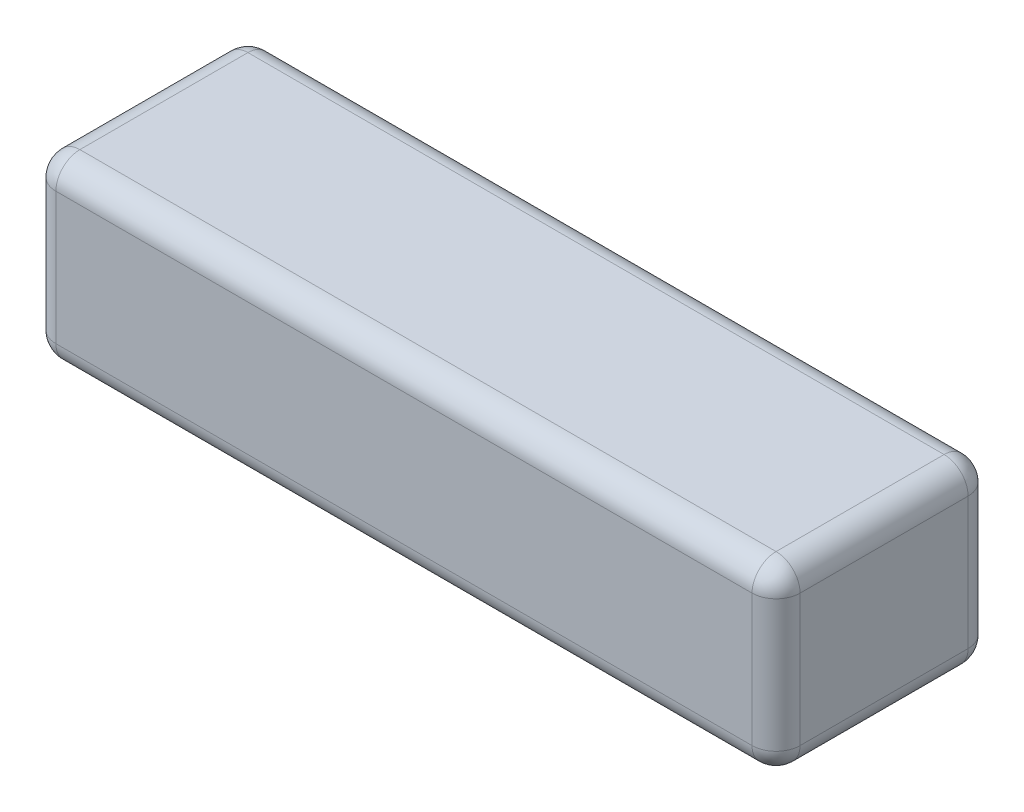
ISO-10303-21;
HEADER;
FILE_DESCRIPTION(('STEP AP214'),'2;1');
FILE_NAME('part.step','',(''),(''),'','','');
FILE_SCHEMA(('AUTOMOTIVE_DESIGN { 1 0 10303 214 1 1 1 1 }'));
ENDSEC;
DATA;
#1=APPLICATION_CONTEXT('core data for automotive mechanical design processes');
#2=APPLICATION_PROTOCOL_DEFINITION('international standard','automotive_design',2000,#1);
#3=PRODUCT_CONTEXT('',#1,'mechanical');
#4=PRODUCT('Part','Part','',(#3));
#5=PRODUCT_RELATED_PRODUCT_CATEGORY('part','',(#4));
#6=PRODUCT_DEFINITION_FORMATION('','',#4);
#7=PRODUCT_DEFINITION_CONTEXT('part definition',#1,'design');
#8=PRODUCT_DEFINITION('design','',#6,#7);
#9=PRODUCT_DEFINITION_SHAPE('','',#8);
#10=(LENGTH_UNIT() NAMED_UNIT(*) SI_UNIT(.MILLI.,.METRE.));
#11=(NAMED_UNIT(*) PLANE_ANGLE_UNIT() SI_UNIT($,.RADIAN.));
#12=(NAMED_UNIT(*) SI_UNIT($,.STERADIAN.) SOLID_ANGLE_UNIT());
#13=UNCERTAINTY_MEASURE_WITH_UNIT(LENGTH_MEASURE(1.E-05),#10,'distance_accuracy_value','');
#14=(GEOMETRIC_REPRESENTATION_CONTEXT(3) GLOBAL_UNCERTAINTY_ASSIGNED_CONTEXT((#13)) GLOBAL_UNIT_ASSIGNED_CONTEXT((#10,
#11,#12)) REPRESENTATION_CONTEXT('',''));
#15=CARTESIAN_POINT('',(0.,0.,0.));
#16=DIRECTION('',(0.,0.,1.));
#17=DIRECTION('',(1.,0.,0.));
#18=AXIS2_PLACEMENT_3D('',#15,#16,#17);
#19=CARTESIAN_POINT('',(31.,7.5,-9.));
#20=DIRECTION('',(-1.,0.,0.));
#21=DIRECTION('',(0.,0.,1.));
#22=AXIS2_PLACEMENT_3D('',#19,#20,#21);
#23=PLANE('',#22);
#24=DIRECTION('',(0.,0.,-1.));
#25=VECTOR('',#24,1.);
#26=CARTESIAN_POINT('',(31.,-5.5,-9.));
#27=LINE('',#26,#25);
#28=CARTESIAN_POINT('',(31.,-5.5,7.));
#29=VERTEX_POINT('',#28);
#30=CARTESIAN_POINT('',(31.,-5.5,-7.));
#31=VERTEX_POINT('',#30);
#32=EDGE_CURVE('E212',#29,#31,#27,.T.);
#33=ORIENTED_EDGE('',*,*,#32,.T.);
#34=DIRECTION('',(0.,-1.,0.));
#35=VECTOR('',#34,1.);
#36=CARTESIAN_POINT('',(31.,7.5,-7.));
#37=LINE('',#36,#35);
#38=CARTESIAN_POINT('',(31.,5.5,-7.));
#39=VERTEX_POINT('',#38);
#40=EDGE_CURVE('E216',#31,#39,#37,.F.);
#41=ORIENTED_EDGE('',*,*,#40,.T.);
#42=DIRECTION('',(0.,0.,-1.));
#43=VECTOR('',#42,1.);
#44=CARTESIAN_POINT('',(31.,5.5,9.));
#45=LINE('',#44,#43);
#46=CARTESIAN_POINT('',(31.,5.5,7.));
#47=VERTEX_POINT('',#46);
#48=EDGE_CURVE('E209',#39,#47,#45,.F.);
#49=ORIENTED_EDGE('',*,*,#48,.T.);
#50=DIRECTION('',(0.,-1.,0.));
#51=VECTOR('',#50,1.);
#52=CARTESIAN_POINT('',(31.,7.5,7.));
#53=LINE('',#52,#51);
#54=EDGE_CURVE('E206',#47,#29,#53,.T.);
#55=ORIENTED_EDGE('',*,*,#54,.T.);
#56=EDGE_LOOP('',(#33,#41,#49,#55));
#57=FACE_BOUND('',#56,.T.);
#58=ADVANCED_FACE('F41',(#57),#23,.F.);
#59=CARTESIAN_POINT('',(-31.,7.5,-9.));
#60=DIRECTION('',(0.,0.,1.));
#61=DIRECTION('',(1.,0.,0.));
#62=AXIS2_PLACEMENT_3D('',#59,#60,#61);
#63=PLANE('',#62);
#64=DIRECTION('',(-1.,0.,0.));
#65=VECTOR('',#64,1.);
#66=CARTESIAN_POINT('',(-31.,-5.5,-9.));
#67=LINE('',#66,#65);
#68=CARTESIAN_POINT('',(29.,-5.5,-9.));
#69=VERTEX_POINT('',#68);
#70=CARTESIAN_POINT('',(-29.,-5.5,-9.));
#71=VERTEX_POINT('',#70);
#72=EDGE_CURVE('E143',#69,#71,#67,.T.);
#73=ORIENTED_EDGE('',*,*,#72,.T.);
#74=DIRECTION('',(0.,-1.,0.));
#75=VECTOR('',#74,1.);
#76=CARTESIAN_POINT('',(-29.,7.5,-9.));
#77=LINE('',#76,#75);
#78=CARTESIAN_POINT('',(-29.,5.5,-9.));
#79=VERTEX_POINT('',#78);
#80=EDGE_CURVE('E138',#71,#79,#77,.F.);
#81=ORIENTED_EDGE('',*,*,#80,.T.);
#82=DIRECTION('',(-1.,0.,0.));
#83=VECTOR('',#82,1.);
#84=CARTESIAN_POINT('',(31.,5.5,-9.));
#85=LINE('',#84,#83);
#86=CARTESIAN_POINT('',(29.,5.5,-9.));
#87=VERTEX_POINT('',#86);
#88=EDGE_CURVE('E130',#79,#87,#85,.F.);
#89=ORIENTED_EDGE('',*,*,#88,.T.);
#90=DIRECTION('',(0.,-1.,0.));
#91=VECTOR('',#90,1.);
#92=CARTESIAN_POINT('',(29.,7.5,-9.));
#93=LINE('',#92,#91);
#94=EDGE_CURVE('E135',#87,#69,#93,.T.);
#95=ORIENTED_EDGE('',*,*,#94,.T.);
#96=EDGE_LOOP('',(#73,#81,#89,#95));
#97=FACE_BOUND('',#96,.T.);
#98=ADVANCED_FACE('F133',(#97),#63,.F.);
#99=CARTESIAN_POINT('',(-31.,7.5,-9.));
#100=DIRECTION('',(1.,0.,0.));
#101=DIRECTION('',(0.,0.,-1.));
#102=AXIS2_PLACEMENT_3D('',#99,#100,#101);
#103=PLANE('',#102);
#104=DIRECTION('',(0.,0.,1.));
#105=VECTOR('',#104,1.);
#106=CARTESIAN_POINT('',(-31.,5.5,-9.));
#107=LINE('',#106,#105);
#108=CARTESIAN_POINT('',(-31.,5.5,7.));
#109=VERTEX_POINT('',#108);
#110=CARTESIAN_POINT('',(-31.,5.5,-7.));
#111=VERTEX_POINT('',#110);
#112=EDGE_CURVE('E51',#109,#111,#107,.F.);
#113=ORIENTED_EDGE('',*,*,#112,.T.);
#114=DIRECTION('',(0.,-1.,0.));
#115=VECTOR('',#114,1.);
#116=CARTESIAN_POINT('',(-31.,7.5,-7.));
#117=LINE('',#116,#115);
#118=CARTESIAN_POINT('',(-31.,-5.5,-7.));
#119=VERTEX_POINT('',#118);
#120=EDGE_CURVE('E11',#111,#119,#117,.T.);
#121=ORIENTED_EDGE('',*,*,#120,.T.);
#122=DIRECTION('',(0.,0.,1.));
#123=VECTOR('',#122,1.);
#124=CARTESIAN_POINT('',(-31.,-5.5,-9.));
#125=LINE('',#124,#123);
#126=CARTESIAN_POINT('',(-31.,-5.5,7.));
#127=VERTEX_POINT('',#126);
#128=EDGE_CURVE('E231',#119,#127,#125,.T.);
#129=ORIENTED_EDGE('',*,*,#128,.T.);
#130=DIRECTION('',(0.,-1.,0.));
#131=VECTOR('',#130,1.);
#132=CARTESIAN_POINT('',(-31.,7.5,7.));
#133=LINE('',#132,#131);
#134=EDGE_CURVE('E62',#127,#109,#133,.F.);
#135=ORIENTED_EDGE('',*,*,#134,.T.);
#136=EDGE_LOOP('',(#113,#121,#129,#135));
#137=FACE_BOUND('',#136,.T.);
#138=ADVANCED_FACE('F326',(#137),#103,.F.);
#139=CARTESIAN_POINT('',(-31.,7.5,9.));
#140=DIRECTION('',(0.,0.,-1.));
#141=DIRECTION('',(-1.,0.,0.));
#142=AXIS2_PLACEMENT_3D('',#139,#140,#141);
#143=PLANE('',#142);
#144=DIRECTION('',(1.,0.,0.));
#145=VECTOR('',#144,1.);
#146=CARTESIAN_POINT('',(-31.,5.5,9.));
#147=LINE('',#146,#145);
#148=CARTESIAN_POINT('',(29.,5.5,9.));
#149=VERTEX_POINT('',#148);
#150=CARTESIAN_POINT('',(-29.,5.5,9.));
#151=VERTEX_POINT('',#150);
#152=EDGE_CURVE('E196',#149,#151,#147,.F.);
#153=ORIENTED_EDGE('',*,*,#152,.T.);
#154=DIRECTION('',(0.,-1.,0.));
#155=VECTOR('',#154,1.);
#156=CARTESIAN_POINT('',(-29.,7.5,9.));
#157=LINE('',#156,#155);
#158=CARTESIAN_POINT('',(-29.,-5.5,9.));
#159=VERTEX_POINT('',#158);
#160=EDGE_CURVE('E203',#151,#159,#157,.T.);
#161=ORIENTED_EDGE('',*,*,#160,.T.);
#162=DIRECTION('',(1.,0.,0.));
#163=VECTOR('',#162,1.);
#164=CARTESIAN_POINT('',(-31.,-5.5,9.));
#165=LINE('',#164,#163);
#166=CARTESIAN_POINT('',(29.,-5.5,9.));
#167=VERTEX_POINT('',#166);
#168=EDGE_CURVE('E199',#159,#167,#165,.T.);
#169=ORIENTED_EDGE('',*,*,#168,.T.);
#170=DIRECTION('',(0.,-1.,0.));
#171=VECTOR('',#170,1.);
#172=CARTESIAN_POINT('',(29.,7.5,9.));
#173=LINE('',#172,#171);
#174=EDGE_CURVE('E193',#167,#149,#173,.F.);
#175=ORIENTED_EDGE('',*,*,#174,.T.);
#176=EDGE_LOOP('',(#153,#161,#169,#175));
#177=FACE_BOUND('',#176,.T.);
#178=ADVANCED_FACE('F349',(#177),#143,.F.);
#179=CARTESIAN_POINT('',(0.,7.5,0.));
#180=DIRECTION('',(0.,1.,0.));
#181=DIRECTION('',(0.,0.,1.));
#182=AXIS2_PLACEMENT_3D('',#179,#180,#181);
#183=PLANE('',#182);
#184=DIRECTION('',(1.,0.,0.));
#185=VECTOR('',#184,1.);
#186=CARTESIAN_POINT('',(31.,7.5,7.));
#187=LINE('',#186,#185);
#188=CARTESIAN_POINT('',(-29.,7.5,7.));
#189=VERTEX_POINT('',#188);
#190=CARTESIAN_POINT('',(29.,7.5,7.));
#191=VERTEX_POINT('',#190);
#192=EDGE_CURVE('E224',#189,#191,#187,.T.);
#193=ORIENTED_EDGE('',*,*,#192,.T.);
#194=DIRECTION('',(0.,0.,-1.));
#195=VECTOR('',#194,1.);
#196=CARTESIAN_POINT('',(29.,7.5,-9.));
#197=LINE('',#196,#195);
#198=CARTESIAN_POINT('',(29.,7.5,-7.));
#199=VERTEX_POINT('',#198);
#200=EDGE_CURVE('E228',#191,#199,#197,.T.);
#201=ORIENTED_EDGE('',*,*,#200,.T.);
#202=DIRECTION('',(-1.,0.,0.));
#203=VECTOR('',#202,1.);
#204=CARTESIAN_POINT('',(-31.,7.5,-7.));
#205=LINE('',#204,#203);
#206=CARTESIAN_POINT('',(-29.,7.5,-7.));
#207=VERTEX_POINT('',#206);
#208=EDGE_CURVE('E150',#199,#207,#205,.T.);
#209=ORIENTED_EDGE('',*,*,#208,.T.);
#210=DIRECTION('',(0.,0.,1.));
#211=VECTOR('',#210,1.);
#212=CARTESIAN_POINT('',(-29.,7.5,9.));
#213=LINE('',#212,#211);
#214=EDGE_CURVE('E219',#207,#189,#213,.T.);
#215=ORIENTED_EDGE('',*,*,#214,.T.);
#216=EDGE_LOOP('',(#193,#201,#209,#215));
#217=FACE_BOUND('',#216,.T.);
#218=ADVANCED_FACE('F366',(#217),#183,.T.);
#219=CARTESIAN_POINT('',(0.,-7.5,0.));
#220=DIRECTION('',(0.,1.,0.));
#221=DIRECTION('',(0.,0.,1.));
#222=AXIS2_PLACEMENT_3D('',#219,#220,#221);
#223=PLANE('',#222);
#224=DIRECTION('',(-1.,0.,0.));
#225=VECTOR('',#224,1.);
#226=CARTESIAN_POINT('',(0.,-7.5,-7.));
#227=LINE('',#226,#225);
#228=CARTESIAN_POINT('',(-29.,-7.5,-7.));
#229=VERTEX_POINT('',#228);
#230=CARTESIAN_POINT('',(29.,-7.5,-7.));
#231=VERTEX_POINT('',#230);
#232=EDGE_CURVE('E186',#229,#231,#227,.F.);
#233=ORIENTED_EDGE('',*,*,#232,.T.);
#234=DIRECTION('',(0.,0.,-1.));
#235=VECTOR('',#234,1.);
#236=CARTESIAN_POINT('',(29.,-7.5,0.));
#237=LINE('',#236,#235);
#238=CARTESIAN_POINT('',(29.,-7.5,7.));
#239=VERTEX_POINT('',#238);
#240=EDGE_CURVE('E190',#231,#239,#237,.F.);
#241=ORIENTED_EDGE('',*,*,#240,.T.);
#242=DIRECTION('',(1.,0.,0.));
#243=VECTOR('',#242,1.);
#244=CARTESIAN_POINT('',(0.,-7.5,7.));
#245=LINE('',#244,#243);
#246=CARTESIAN_POINT('',(-29.,-7.5,7.));
#247=VERTEX_POINT('',#246);
#248=EDGE_CURVE('E183',#239,#247,#245,.F.);
#249=ORIENTED_EDGE('',*,*,#248,.T.);
#250=DIRECTION('',(0.,0.,1.));
#251=VECTOR('',#250,1.);
#252=CARTESIAN_POINT('',(-29.,-7.5,0.));
#253=LINE('',#252,#251);
#254=EDGE_CURVE('E180',#247,#229,#253,.F.);
#255=ORIENTED_EDGE('',*,*,#254,.T.);
#256=EDGE_LOOP('',(#233,#241,#249,#255));
#257=FACE_BOUND('',#256,.T.);
#258=ADVANCED_FACE('F340',(#257),#223,.F.);
#259=CARTESIAN_POINT('',(0.,5.5,7.));
#260=DIRECTION('',(-1.,0.,0.));
#261=DIRECTION('',(0.,0.,1.));
#262=AXIS2_PLACEMENT_3D('',#259,#260,#261);
#263=CYLINDRICAL_SURFACE('',#262,2.);
#264=CARTESIAN_POINT('',(29.,5.5,7.));
#265=DIRECTION('',(1.,0.,0.));
#266=DIRECTION('',(0.,0.,-1.));
#267=AXIS2_PLACEMENT_3D('',#264,#265,#266);
#268=CIRCLE('',#267,2.);
#269=EDGE_CURVE('E45',#191,#149,#268,.T.);
#270=ORIENTED_EDGE('',*,*,#269,.F.);
#271=ORIENTED_EDGE('',*,*,#192,.F.);
#272=CARTESIAN_POINT('',(-29.,5.5,7.));
#273=DIRECTION('',(-1.,0.,0.));
#274=DIRECTION('',(0.,-1.,0.));
#275=AXIS2_PLACEMENT_3D('',#272,#273,#274);
#276=CIRCLE('',#275,2.);
#277=EDGE_CURVE('E174',#151,#189,#276,.T.);
#278=ORIENTED_EDGE('',*,*,#277,.F.);
#279=ORIENTED_EDGE('',*,*,#152,.F.);
#280=EDGE_LOOP('',(#270,#271,#278,#279));
#281=FACE_BOUND('',#280,.T.);
#282=ADVANCED_FACE('F43',(#281),#263,.T.);
#283=CARTESIAN_POINT('',(29.,5.5,7.));
#284=DIRECTION('',(0.,0.,1.));
#285=DIRECTION('',(1.,0.,0.));
#286=AXIS2_PLACEMENT_3D('',#283,#284,#285);
#287=SPHERICAL_SURFACE('',#286,2.);
#288=CARTESIAN_POINT('',(29.,5.5,7.));
#289=DIRECTION('',(0.,0.,1.));
#290=DIRECTION('',(0.,-1.,0.));
#291=AXIS2_PLACEMENT_3D('',#288,#289,#290);
#292=CIRCLE('',#291,2.);
#293=EDGE_CURVE('E297',#191,#47,#292,.F.);
#294=ORIENTED_EDGE('',*,*,#293,.F.);
#295=ORIENTED_EDGE('',*,*,#269,.T.);
#296=CARTESIAN_POINT('',(29.,5.5,7.));
#297=DIRECTION('',(0.,1.,0.));
#298=DIRECTION('',(0.,0.,1.));
#299=AXIS2_PLACEMENT_3D('',#296,#297,#298);
#300=CIRCLE('',#299,2.);
#301=EDGE_CURVE('E301',#47,#149,#300,.F.);
#302=ORIENTED_EDGE('',*,*,#301,.F.);
#303=EDGE_LOOP('',(#294,#295,#302));
#304=FACE_BOUND('',#303,.T.);
#305=ADVANCED_FACE('F354',(#304),#287,.T.);
#306=CARTESIAN_POINT('',(-29.,5.5,7.));
#307=DIRECTION('',(0.,0.,1.));
#308=DIRECTION('',(1.,0.,0.));
#309=AXIS2_PLACEMENT_3D('',#306,#307,#308);
#310=SPHERICAL_SURFACE('',#309,2.);
#311=CARTESIAN_POINT('',(-29.,5.5,7.));
#312=DIRECTION('',(0.,1.,0.));
#313=DIRECTION('',(0.,0.,1.));
#314=AXIS2_PLACEMENT_3D('',#311,#312,#313);
#315=CIRCLE('',#314,2.);
#316=EDGE_CURVE('E290',#151,#109,#315,.F.);
#317=ORIENTED_EDGE('',*,*,#316,.F.);
#318=ORIENTED_EDGE('',*,*,#277,.T.);
#319=CARTESIAN_POINT('',(-29.,5.5,7.));
#320=DIRECTION('',(0.,0.,1.));
#321=DIRECTION('',(1.,0.,0.));
#322=AXIS2_PLACEMENT_3D('',#319,#320,#321);
#323=CIRCLE('',#322,2.);
#324=EDGE_CURVE('E293',#109,#189,#323,.F.);
#325=ORIENTED_EDGE('',*,*,#324,.F.);
#326=EDGE_LOOP('',(#317,#318,#325));
#327=FACE_BOUND('',#326,.T.);
#328=ADVANCED_FACE('F310',(#327),#310,.T.);
#329=CARTESIAN_POINT('',(29.,7.5,7.));
#330=DIRECTION('',(0.,-1.,0.));
#331=DIRECTION('',(0.,0.,-1.));
#332=AXIS2_PLACEMENT_3D('',#329,#330,#331);
#333=CYLINDRICAL_SURFACE('',#332,2.);
#334=ORIENTED_EDGE('',*,*,#301,.T.);
#335=ORIENTED_EDGE('',*,*,#174,.F.);
#336=CARTESIAN_POINT('',(29.,-5.5,7.));
#337=DIRECTION('',(0.,-1.,0.));
#338=DIRECTION('',(0.,0.,-1.));
#339=AXIS2_PLACEMENT_3D('',#336,#337,#338);
#340=CIRCLE('',#339,2.);
#341=EDGE_CURVE('E283',#29,#167,#340,.T.);
#342=ORIENTED_EDGE('',*,*,#341,.F.);
#343=ORIENTED_EDGE('',*,*,#54,.F.);
#344=EDGE_LOOP('',(#334,#335,#342,#343));
#345=FACE_BOUND('',#344,.T.);
#346=ADVANCED_FACE('F357',(#345),#333,.T.);
#347=CARTESIAN_POINT('',(29.,5.5,0.));
#348=DIRECTION('',(0.,0.,1.));
#349=DIRECTION('',(1.,0.,0.));
#350=AXIS2_PLACEMENT_3D('',#347,#348,#349);
#351=CYLINDRICAL_SURFACE('',#350,2.);
#352=ORIENTED_EDGE('',*,*,#293,.T.);
#353=ORIENTED_EDGE('',*,*,#48,.F.);
#354=CARTESIAN_POINT('',(29.,5.5,-7.));
#355=DIRECTION('',(0.,0.,-1.));
#356=DIRECTION('',(-1.,0.,0.));
#357=AXIS2_PLACEMENT_3D('',#354,#355,#356);
#358=CIRCLE('',#357,2.);
#359=EDGE_CURVE('E155',#199,#39,#358,.T.);
#360=ORIENTED_EDGE('',*,*,#359,.F.);
#361=ORIENTED_EDGE('',*,*,#200,.F.);
#362=EDGE_LOOP('',(#352,#353,#360,#361));
#363=FACE_BOUND('',#362,.T.);
#364=ADVANCED_FACE('F364',(#363),#351,.T.);
#365=CARTESIAN_POINT('',(0.,5.5,-7.));
#366=DIRECTION('',(1.,0.,0.));
#367=DIRECTION('',(0.,0.,-1.));
#368=AXIS2_PLACEMENT_3D('',#365,#366,#367);
#369=CYLINDRICAL_SURFACE('',#368,2.);
#370=CARTESIAN_POINT('',(-29.,5.5,-7.));
#371=DIRECTION('',(-1.,0.,0.));
#372=DIRECTION('',(0.,0.,1.));
#373=AXIS2_PLACEMENT_3D('',#370,#371,#372);
#374=CIRCLE('',#373,2.);
#375=EDGE_CURVE('E156',#207,#79,#374,.T.);
#376=ORIENTED_EDGE('',*,*,#375,.F.);
#377=ORIENTED_EDGE('',*,*,#208,.F.);
#378=CARTESIAN_POINT('',(29.,5.5,-7.));
#379=DIRECTION('',(1.,0.,0.));
#380=DIRECTION('',(0.,0.,-1.));
#381=AXIS2_PLACEMENT_3D('',#378,#379,#380);
#382=CIRCLE('',#381,2.);
#383=EDGE_CURVE('E147',#87,#199,#382,.T.);
#384=ORIENTED_EDGE('',*,*,#383,.F.);
#385=ORIENTED_EDGE('',*,*,#88,.F.);
#386=EDGE_LOOP('',(#376,#377,#384,#385));
#387=FACE_BOUND('',#386,.T.);
#388=ADVANCED_FACE('F149',(#387),#369,.T.);
#389=CARTESIAN_POINT('',(-29.,5.5,0.));
#390=DIRECTION('',(0.,0.,-1.));
#391=DIRECTION('',(-1.,0.,0.));
#392=AXIS2_PLACEMENT_3D('',#389,#390,#391);
#393=CYLINDRICAL_SURFACE('',#392,2.);
#394=ORIENTED_EDGE('',*,*,#324,.T.);
#395=ORIENTED_EDGE('',*,*,#214,.F.);
#396=CARTESIAN_POINT('',(-29.,5.5,-7.));
#397=DIRECTION('',(0.,0.,-1.));
#398=DIRECTION('',(-1.,0.,0.));
#399=AXIS2_PLACEMENT_3D('',#396,#397,#398);
#400=CIRCLE('',#399,2.);
#401=EDGE_CURVE('E275',#111,#207,#400,.T.);
#402=ORIENTED_EDGE('',*,*,#401,.F.);
#403=ORIENTED_EDGE('',*,*,#112,.F.);
#404=EDGE_LOOP('',(#394,#395,#402,#403));
#405=FACE_BOUND('',#404,.T.);
#406=ADVANCED_FACE('F317',(#405),#393,.T.);
#407=CARTESIAN_POINT('',(-29.,7.5,7.));
#408=DIRECTION('',(0.,-1.,0.));
#409=DIRECTION('',(0.,0.,-1.));
#410=AXIS2_PLACEMENT_3D('',#407,#408,#409);
#411=CYLINDRICAL_SURFACE('',#410,2.);
#412=ORIENTED_EDGE('',*,*,#316,.T.);
#413=ORIENTED_EDGE('',*,*,#134,.F.);
#414=CARTESIAN_POINT('',(-29.,-5.5,7.));
#415=DIRECTION('',(0.,-1.,0.));
#416=DIRECTION('',(0.,0.,-1.));
#417=AXIS2_PLACEMENT_3D('',#414,#415,#416);
#418=CIRCLE('',#417,2.);
#419=EDGE_CURVE('E271',#159,#127,#418,.T.);
#420=ORIENTED_EDGE('',*,*,#419,.F.);
#421=ORIENTED_EDGE('',*,*,#160,.F.);
#422=EDGE_LOOP('',(#412,#413,#420,#421));
#423=FACE_BOUND('',#422,.T.);
#424=ADVANCED_FACE('F331',(#423),#411,.T.);
#425=CARTESIAN_POINT('',(-31.,-5.5,7.));
#426=DIRECTION('',(1.,0.,0.));
#427=DIRECTION('',(0.,0.,-1.));
#428=AXIS2_PLACEMENT_3D('',#425,#426,#427);
#429=CYLINDRICAL_SURFACE('',#428,2.);
#430=CARTESIAN_POINT('',(29.,-5.5,7.));
#431=DIRECTION('',(1.,0.,0.));
#432=DIRECTION('',(0.,0.,-1.));
#433=AXIS2_PLACEMENT_3D('',#430,#431,#432);
#434=CIRCLE('',#433,2.);
#435=EDGE_CURVE('E286',#167,#239,#434,.T.);
#436=ORIENTED_EDGE('',*,*,#435,.F.);
#437=ORIENTED_EDGE('',*,*,#168,.F.);
#438=CARTESIAN_POINT('',(-29.,-5.5,7.));
#439=DIRECTION('',(-1.,0.,0.));
#440=DIRECTION('',(0.,0.,1.));
#441=AXIS2_PLACEMENT_3D('',#438,#439,#440);
#442=CIRCLE('',#441,2.);
#443=EDGE_CURVE('E267',#247,#159,#442,.T.);
#444=ORIENTED_EDGE('',*,*,#443,.F.);
#445=ORIENTED_EDGE('',*,*,#248,.F.);
#446=EDGE_LOOP('',(#436,#437,#444,#445));
#447=FACE_BOUND('',#446,.T.);
#448=ADVANCED_FACE('F346',(#447),#429,.T.);
#449=CARTESIAN_POINT('',(29.,-5.5,7.));
#450=DIRECTION('',(0.,0.,1.));
#451=DIRECTION('',(1.,0.,0.));
#452=AXIS2_PLACEMENT_3D('',#449,#450,#451);
#453=SPHERICAL_SURFACE('',#452,2.);
#454=ORIENTED_EDGE('',*,*,#341,.T.);
#455=ORIENTED_EDGE('',*,*,#435,.T.);
#456=CARTESIAN_POINT('',(29.,-5.5,7.));
#457=DIRECTION('',(0.,0.,1.));
#458=DIRECTION('',(1.,0.,0.));
#459=AXIS2_PLACEMENT_3D('',#456,#457,#458);
#460=CIRCLE('',#459,2.);
#461=EDGE_CURVE('E164',#29,#239,#460,.F.);
#462=ORIENTED_EDGE('',*,*,#461,.F.);
#463=EDGE_LOOP('',(#454,#455,#462));
#464=FACE_BOUND('',#463,.T.);
#465=ADVANCED_FACE('F411',(#464),#453,.T.);
#466=CARTESIAN_POINT('',(29.,5.5,-7.));
#467=DIRECTION('',(0.,0.,1.));
#468=DIRECTION('',(1.,0.,0.));
#469=AXIS2_PLACEMENT_3D('',#466,#467,#468);
#470=SPHERICAL_SURFACE('',#469,2.);
#471=ORIENTED_EDGE('',*,*,#383,.T.);
#472=ORIENTED_EDGE('',*,*,#359,.T.);
#473=CARTESIAN_POINT('',(29.,5.5,-7.));
#474=DIRECTION('',(0.,1.,0.));
#475=DIRECTION('',(0.,0.,1.));
#476=AXIS2_PLACEMENT_3D('',#473,#474,#475);
#477=CIRCLE('',#476,2.);
#478=EDGE_CURVE('E159',#87,#39,#477,.F.);
#479=ORIENTED_EDGE('',*,*,#478,.F.);
#480=EDGE_LOOP('',(#471,#472,#479));
#481=FACE_BOUND('',#480,.T.);
#482=ADVANCED_FACE('F160',(#481),#470,.T.);
#483=CARTESIAN_POINT('',(-29.,5.5,-7.));
#484=DIRECTION('',(0.,0.,1.));
#485=DIRECTION('',(1.,0.,0.));
#486=AXIS2_PLACEMENT_3D('',#483,#484,#485);
#487=SPHERICAL_SURFACE('',#486,2.);
#488=ORIENTED_EDGE('',*,*,#401,.T.);
#489=ORIENTED_EDGE('',*,*,#375,.T.);
#490=CARTESIAN_POINT('',(-29.,5.5,-7.));
#491=DIRECTION('',(0.,1.,0.));
#492=DIRECTION('',(0.,0.,1.));
#493=AXIS2_PLACEMENT_3D('',#490,#491,#492);
#494=CIRCLE('',#493,2.);
#495=EDGE_CURVE('E165',#111,#79,#494,.F.);
#496=ORIENTED_EDGE('',*,*,#495,.F.);
#497=EDGE_LOOP('',(#488,#489,#496));
#498=FACE_BOUND('',#497,.T.);
#499=ADVANCED_FACE('F321',(#498),#487,.T.);
#500=CARTESIAN_POINT('',(-29.,-5.5,7.));
#501=DIRECTION('',(0.,0.,1.));
#502=DIRECTION('',(1.,0.,0.));
#503=AXIS2_PLACEMENT_3D('',#500,#501,#502);
#504=SPHERICAL_SURFACE('',#503,2.);
#505=ORIENTED_EDGE('',*,*,#443,.T.);
#506=ORIENTED_EDGE('',*,*,#419,.T.);
#507=CARTESIAN_POINT('',(-29.,-5.5,7.));
#508=DIRECTION('',(0.,0.,1.));
#509=DIRECTION('',(1.,0.,0.));
#510=AXIS2_PLACEMENT_3D('',#507,#508,#509);
#511=CIRCLE('',#510,2.);
#512=EDGE_CURVE('E257',#247,#127,#511,.F.);
#513=ORIENTED_EDGE('',*,*,#512,.F.);
#514=EDGE_LOOP('',(#505,#506,#513));
#515=FACE_BOUND('',#514,.T.);
#516=ADVANCED_FACE('F334',(#515),#504,.T.);
#517=CARTESIAN_POINT('',(29.,-5.5,-9.));
#518=DIRECTION('',(0.,0.,-1.));
#519=DIRECTION('',(-1.,0.,0.));
#520=AXIS2_PLACEMENT_3D('',#517,#518,#519);
#521=CYLINDRICAL_SURFACE('',#520,2.);
#522=ORIENTED_EDGE('',*,*,#461,.T.);
#523=ORIENTED_EDGE('',*,*,#240,.F.);
#524=CARTESIAN_POINT('',(29.,-5.5,-7.));
#525=DIRECTION('',(0.,0.,-1.));
#526=DIRECTION('',(-1.,0.,0.));
#527=AXIS2_PLACEMENT_3D('',#524,#525,#526);
#528=CIRCLE('',#527,2.);
#529=EDGE_CURVE('E253',#31,#231,#528,.T.);
#530=ORIENTED_EDGE('',*,*,#529,.F.);
#531=ORIENTED_EDGE('',*,*,#32,.F.);
#532=EDGE_LOOP('',(#522,#523,#530,#531));
#533=FACE_BOUND('',#532,.T.);
#534=ADVANCED_FACE('F401',(#533),#521,.T.);
#535=CARTESIAN_POINT('',(29.,7.5,-7.));
#536=DIRECTION('',(0.,-1.,0.));
#537=DIRECTION('',(0.,0.,-1.));
#538=AXIS2_PLACEMENT_3D('',#535,#536,#537);
#539=CYLINDRICAL_SURFACE('',#538,2.);
#540=ORIENTED_EDGE('',*,*,#478,.T.);
#541=ORIENTED_EDGE('',*,*,#40,.F.);
#542=CARTESIAN_POINT('',(29.,-5.5,-7.));
#543=DIRECTION('',(0.,-1.,0.));
#544=DIRECTION('',(0.,0.,-1.));
#545=AXIS2_PLACEMENT_3D('',#542,#543,#544);
#546=CIRCLE('',#545,2.);
#547=EDGE_CURVE('E168',#69,#31,#546,.T.);
#548=ORIENTED_EDGE('',*,*,#547,.F.);
#549=ORIENTED_EDGE('',*,*,#94,.F.);
#550=EDGE_LOOP('',(#540,#541,#548,#549));
#551=FACE_BOUND('',#550,.T.);
#552=ADVANCED_FACE('F167',(#551),#539,.T.);
#553=CARTESIAN_POINT('',(-29.,7.5,-7.));
#554=DIRECTION('',(0.,-1.,0.));
#555=DIRECTION('',(0.,0.,-1.));
#556=AXIS2_PLACEMENT_3D('',#553,#554,#555);
#557=CYLINDRICAL_SURFACE('',#556,2.);
#558=ORIENTED_EDGE('',*,*,#495,.T.);
#559=ORIENTED_EDGE('',*,*,#80,.F.);
#560=CARTESIAN_POINT('',(-29.,-5.5,-7.));
#561=DIRECTION('',(0.,-1.,0.));
#562=DIRECTION('',(0.,0.,-1.));
#563=AXIS2_PLACEMENT_3D('',#560,#561,#562);
#564=CIRCLE('',#563,2.);
#565=EDGE_CURVE('E247',#119,#71,#564,.T.);
#566=ORIENTED_EDGE('',*,*,#565,.F.);
#567=ORIENTED_EDGE('',*,*,#120,.F.);
#568=EDGE_LOOP('',(#558,#559,#566,#567));
#569=FACE_BOUND('',#568,.T.);
#570=ADVANCED_FACE('F324',(#569),#557,.T.);
#571=CARTESIAN_POINT('',(-29.,-5.5,-9.));
#572=DIRECTION('',(0.,0.,1.));
#573=DIRECTION('',(1.,0.,0.));
#574=AXIS2_PLACEMENT_3D('',#571,#572,#573);
#575=CYLINDRICAL_SURFACE('',#574,2.);
#576=ORIENTED_EDGE('',*,*,#512,.T.);
#577=ORIENTED_EDGE('',*,*,#128,.F.);
#578=CARTESIAN_POINT('',(-29.,-5.5,-7.));
#579=DIRECTION('',(0.,0.,-1.));
#580=DIRECTION('',(-1.,0.,0.));
#581=AXIS2_PLACEMENT_3D('',#578,#579,#580);
#582=CIRCLE('',#581,2.);
#583=EDGE_CURVE('E244',#229,#119,#582,.T.);
#584=ORIENTED_EDGE('',*,*,#583,.F.);
#585=ORIENTED_EDGE('',*,*,#254,.F.);
#586=EDGE_LOOP('',(#576,#577,#584,#585));
#587=FACE_BOUND('',#586,.T.);
#588=ADVANCED_FACE('F337',(#587),#575,.T.);
#589=CARTESIAN_POINT('',(29.,-5.5,-7.));
#590=DIRECTION('',(0.,0.,1.));
#591=DIRECTION('',(1.,0.,0.));
#592=AXIS2_PLACEMENT_3D('',#589,#590,#591);
#593=SPHERICAL_SURFACE('',#592,2.);
#594=ORIENTED_EDGE('',*,*,#547,.T.);
#595=ORIENTED_EDGE('',*,*,#529,.T.);
#596=CARTESIAN_POINT('',(29.,-5.5,-7.));
#597=DIRECTION('',(1.,0.,0.));
#598=DIRECTION('',(0.,0.,-1.));
#599=AXIS2_PLACEMENT_3D('',#596,#597,#598);
#600=CIRCLE('',#599,2.);
#601=EDGE_CURVE('E241',#69,#231,#600,.F.);
#602=ORIENTED_EDGE('',*,*,#601,.F.);
#603=EDGE_LOOP('',(#594,#595,#602));
#604=FACE_BOUND('',#603,.T.);
#605=ADVANCED_FACE('F390',(#604),#593,.T.);
#606=CARTESIAN_POINT('',(-29.,-5.5,-7.));
#607=DIRECTION('',(0.,0.,1.));
#608=DIRECTION('',(1.,0.,0.));
#609=AXIS2_PLACEMENT_3D('',#606,#607,#608);
#610=SPHERICAL_SURFACE('',#609,2.);
#611=ORIENTED_EDGE('',*,*,#583,.T.);
#612=ORIENTED_EDGE('',*,*,#565,.T.);
#613=CARTESIAN_POINT('',(-29.,-5.5,-7.));
#614=DIRECTION('',(-1.,0.,0.));
#615=DIRECTION('',(0.,0.,1.));
#616=AXIS2_PLACEMENT_3D('',#613,#614,#615);
#617=CIRCLE('',#616,2.);
#618=EDGE_CURVE('E238',#229,#71,#617,.F.);
#619=ORIENTED_EDGE('',*,*,#618,.F.);
#620=EDGE_LOOP('',(#611,#612,#619));
#621=FACE_BOUND('',#620,.T.);
#622=ADVANCED_FACE('F386',(#621),#610,.T.);
#623=CARTESIAN_POINT('',(-31.,-5.5,-7.));
#624=DIRECTION('',(-1.,0.,0.));
#625=DIRECTION('',(0.,0.,1.));
#626=AXIS2_PLACEMENT_3D('',#623,#624,#625);
#627=CYLINDRICAL_SURFACE('',#626,2.);
#628=ORIENTED_EDGE('',*,*,#601,.T.);
#629=ORIENTED_EDGE('',*,*,#232,.F.);
#630=ORIENTED_EDGE('',*,*,#618,.T.);
#631=ORIENTED_EDGE('',*,*,#72,.F.);
#632=EDGE_LOOP('',(#628,#629,#630,#631));
#633=FACE_BOUND('',#632,.T.);
#634=ADVANCED_FACE('F383',(#633),#627,.T.);
#635=CLOSED_SHELL('',(#58,#98,#138,#178,#218,#258,#282,#305,#328,#346,#364,#388,#406,#424,#448,
#465,#482,#499,#516,#534,#552,#570,#588,#605,#622,#634));
#636=MANIFOLD_SOLID_BREP('B2',#635);
#637=ADVANCED_BREP_SHAPE_REPRESENTATION('',(#18,#636),#14);
#638=SHAPE_DEFINITION_REPRESENTATION(#9,#637);
ENDSEC;
END-ISO-10303-21;
